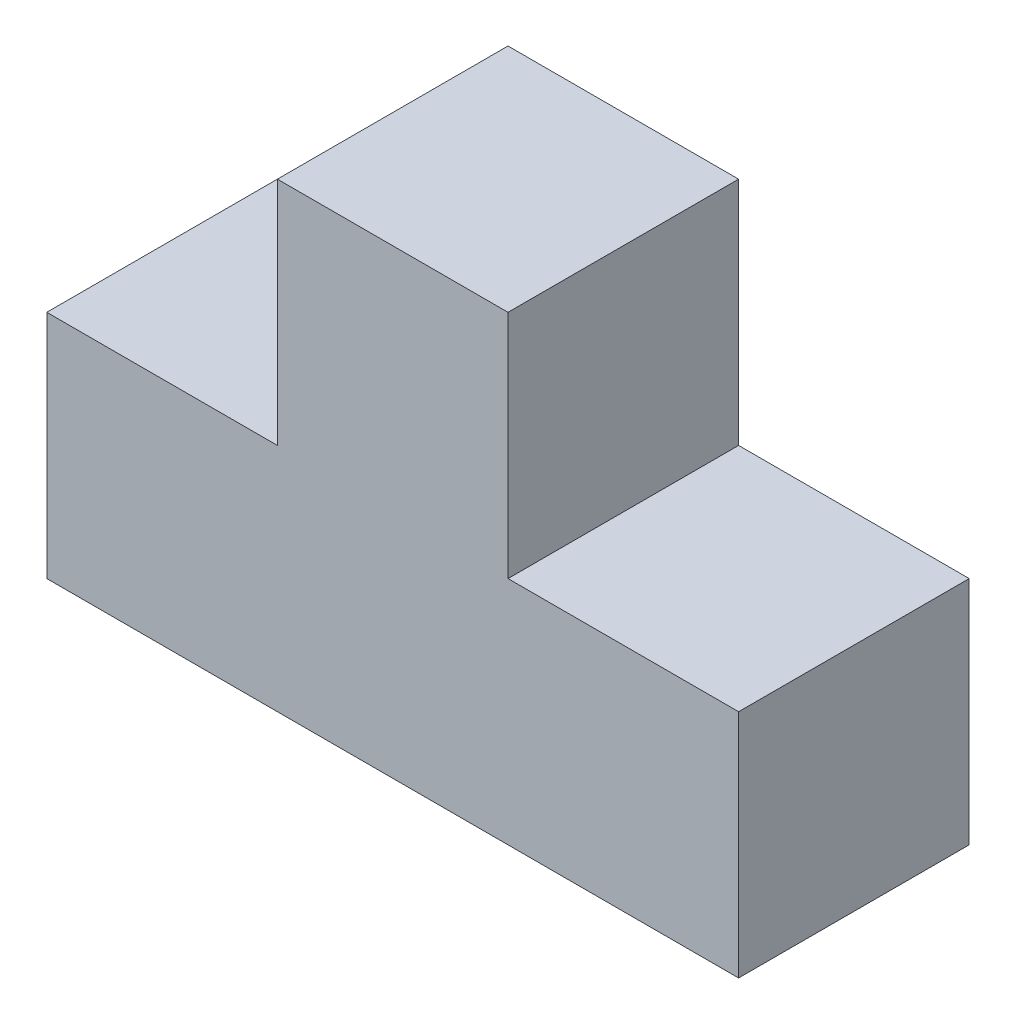
ISO-10303-21;
HEADER;
FILE_DESCRIPTION(('STEP AP214'),'2;1');
FILE_NAME('part.step','',(''),(''),'','','');
FILE_SCHEMA(('AUTOMOTIVE_DESIGN { 1 0 10303 214 1 1 1 1 }'));
ENDSEC;
DATA;
#1=APPLICATION_CONTEXT('core data for automotive mechanical design processes');
#2=APPLICATION_PROTOCOL_DEFINITION('international standard','automotive_design',2000,#1);
#3=PRODUCT_CONTEXT('',#1,'mechanical');
#4=PRODUCT('Part','Part','',(#3));
#5=PRODUCT_RELATED_PRODUCT_CATEGORY('part','',(#4));
#6=PRODUCT_DEFINITION_FORMATION('','',#4);
#7=PRODUCT_DEFINITION_CONTEXT('part definition',#1,'design');
#8=PRODUCT_DEFINITION('design','',#6,#7);
#9=PRODUCT_DEFINITION_SHAPE('','',#8);
#10=(LENGTH_UNIT() NAMED_UNIT(*) SI_UNIT(.MILLI.,.METRE.));
#11=(NAMED_UNIT(*) PLANE_ANGLE_UNIT() SI_UNIT($,.RADIAN.));
#12=(NAMED_UNIT(*) SI_UNIT($,.STERADIAN.) SOLID_ANGLE_UNIT());
#13=UNCERTAINTY_MEASURE_WITH_UNIT(LENGTH_MEASURE(1.E-05),#10,'distance_accuracy_value','');
#14=(GEOMETRIC_REPRESENTATION_CONTEXT(3) GLOBAL_UNCERTAINTY_ASSIGNED_CONTEXT((#13)) GLOBAL_UNIT_ASSIGNED_CONTEXT((#10,
#11,#12)) REPRESENTATION_CONTEXT('',''));
#15=CARTESIAN_POINT('',(0.,0.,0.));
#16=DIRECTION('',(0.,0.,1.));
#17=DIRECTION('',(1.,0.,0.));
#18=AXIS2_PLACEMENT_3D('',#15,#16,#17);
#19=CARTESIAN_POINT('',(0.,30.,30.));
#20=DIRECTION('',(1.,0.,0.));
#21=DIRECTION('',(0.,0.,-1.));
#22=AXIS2_PLACEMENT_3D('',#19,#20,#21);
#23=PLANE('',#22);
#24=DIRECTION('',(0.,-1.,0.));
#25=VECTOR('',#24,1.);
#26=CARTESIAN_POINT('',(0.,30.,0.));
#27=LINE('',#26,#25);
#28=CARTESIAN_POINT('',(0.,30.,0.));
#29=VERTEX_POINT('',#28);
#30=CARTESIAN_POINT('',(0.,0.,0.));
#31=VERTEX_POINT('',#30);
#32=EDGE_CURVE('E144',#29,#31,#27,.T.);
#33=ORIENTED_EDGE('',*,*,#32,.T.);
#34=DIRECTION('',(0.,0.,-1.));
#35=VECTOR('',#34,1.);
#36=CARTESIAN_POINT('',(0.,0.,30.));
#37=LINE('',#36,#35);
#38=CARTESIAN_POINT('',(0.,0.,30.));
#39=VERTEX_POINT('',#38);
#40=EDGE_CURVE('E11',#39,#31,#37,.T.);
#41=ORIENTED_EDGE('',*,*,#40,.F.);
#42=DIRECTION('',(0.,-1.,0.));
#43=VECTOR('',#42,1.);
#44=CARTESIAN_POINT('',(0.,30.,30.));
#45=LINE('',#44,#43);
#46=CARTESIAN_POINT('',(0.,30.,30.));
#47=VERTEX_POINT('',#46);
#48=EDGE_CURVE('E166',#47,#39,#45,.T.);
#49=ORIENTED_EDGE('',*,*,#48,.F.);
#50=DIRECTION('',(0.,0.,-1.));
#51=VECTOR('',#50,1.);
#52=CARTESIAN_POINT('',(0.,30.,30.));
#53=LINE('',#52,#51);
#54=EDGE_CURVE('E140',#47,#29,#53,.T.);
#55=ORIENTED_EDGE('',*,*,#54,.T.);
#56=EDGE_LOOP('',(#33,#41,#49,#55));
#57=FACE_BOUND('',#56,.T.);
#58=ADVANCED_FACE('F43',(#57),#23,.F.);
#59=CARTESIAN_POINT('',(0.,0.,30.));
#60=DIRECTION('',(0.,1.,0.));
#61=DIRECTION('',(0.,0.,1.));
#62=AXIS2_PLACEMENT_3D('',#59,#60,#61);
#63=PLANE('',#62);
#64=DIRECTION('',(1.,0.,0.));
#65=VECTOR('',#64,1.);
#66=CARTESIAN_POINT('',(0.,0.,0.));
#67=LINE('',#66,#65);
#68=CARTESIAN_POINT('',(90.,0.,0.));
#69=VERTEX_POINT('',#68);
#70=EDGE_CURVE('E148',#31,#69,#67,.T.);
#71=ORIENTED_EDGE('',*,*,#70,.T.);
#72=DIRECTION('',(0.,0.,-1.));
#73=VECTOR('',#72,1.);
#74=CARTESIAN_POINT('',(90.,0.,30.));
#75=LINE('',#74,#73);
#76=CARTESIAN_POINT('',(90.,0.,30.));
#77=VERTEX_POINT('',#76);
#78=EDGE_CURVE('E52',#77,#69,#75,.T.);
#79=ORIENTED_EDGE('',*,*,#78,.F.);
#80=DIRECTION('',(1.,0.,0.));
#81=VECTOR('',#80,1.);
#82=CARTESIAN_POINT('',(0.,0.,30.));
#83=LINE('',#82,#81);
#84=EDGE_CURVE('E103',#39,#77,#83,.T.);
#85=ORIENTED_EDGE('',*,*,#84,.F.);
#86=ORIENTED_EDGE('',*,*,#40,.T.);
#87=EDGE_LOOP('',(#71,#79,#85,#86));
#88=FACE_BOUND('',#87,.T.);
#89=ADVANCED_FACE('F212',(#88),#63,.F.);
#90=CARTESIAN_POINT('',(90.,0.,30.));
#91=DIRECTION('',(-1.,0.,0.));
#92=DIRECTION('',(0.,0.,1.));
#93=AXIS2_PLACEMENT_3D('',#90,#91,#92);
#94=PLANE('',#93);
#95=DIRECTION('',(0.,1.,0.));
#96=VECTOR('',#95,1.);
#97=CARTESIAN_POINT('',(90.,0.,0.));
#98=LINE('',#97,#96);
#99=CARTESIAN_POINT('',(90.,30.,0.));
#100=VERTEX_POINT('',#99);
#101=EDGE_CURVE('E151',#69,#100,#98,.T.);
#102=ORIENTED_EDGE('',*,*,#101,.T.);
#103=DIRECTION('',(0.,0.,-1.));
#104=VECTOR('',#103,1.);
#105=CARTESIAN_POINT('',(90.,30.,30.));
#106=LINE('',#105,#104);
#107=CARTESIAN_POINT('',(90.,30.,30.));
#108=VERTEX_POINT('',#107);
#109=EDGE_CURVE('E177',#108,#100,#106,.T.);
#110=ORIENTED_EDGE('',*,*,#109,.F.);
#111=DIRECTION('',(0.,1.,0.));
#112=VECTOR('',#111,1.);
#113=CARTESIAN_POINT('',(90.,0.,30.));
#114=LINE('',#113,#112);
#115=EDGE_CURVE('E187',#77,#108,#114,.T.);
#116=ORIENTED_EDGE('',*,*,#115,.F.);
#117=ORIENTED_EDGE('',*,*,#78,.T.);
#118=EDGE_LOOP('',(#102,#110,#116,#117));
#119=FACE_BOUND('',#118,.T.);
#120=ADVANCED_FACE('F185',(#119),#94,.F.);
#121=CARTESIAN_POINT('',(90.,30.,30.));
#122=DIRECTION('',(0.,-1.,0.));
#123=DIRECTION('',(1.,0.,0.));
#124=AXIS2_PLACEMENT_3D('',#121,#122,#123);
#125=PLANE('',#124);
#126=DIRECTION('',(-1.,0.,0.));
#127=VECTOR('',#126,1.);
#128=CARTESIAN_POINT('',(90.,30.,0.));
#129=LINE('',#128,#127);
#130=CARTESIAN_POINT('',(60.,30.,0.));
#131=VERTEX_POINT('',#130);
#132=EDGE_CURVE('E154',#100,#131,#129,.T.);
#133=ORIENTED_EDGE('',*,*,#132,.T.);
#134=DIRECTION('',(0.,0.,-1.));
#135=VECTOR('',#134,1.);
#136=CARTESIAN_POINT('',(60.,30.,30.));
#137=LINE('',#136,#135);
#138=CARTESIAN_POINT('',(60.,30.,30.));
#139=VERTEX_POINT('',#138);
#140=EDGE_CURVE('E173',#139,#131,#137,.T.);
#141=ORIENTED_EDGE('',*,*,#140,.F.);
#142=DIRECTION('',(-1.,0.,0.));
#143=VECTOR('',#142,1.);
#144=CARTESIAN_POINT('',(90.,30.,30.));
#145=LINE('',#144,#143);
#146=EDGE_CURVE('E200',#108,#139,#145,.T.);
#147=ORIENTED_EDGE('',*,*,#146,.F.);
#148=ORIENTED_EDGE('',*,*,#109,.T.);
#149=EDGE_LOOP('',(#133,#141,#147,#148));
#150=FACE_BOUND('',#149,.T.);
#151=ADVANCED_FACE('F195',(#150),#125,.F.);
#152=CARTESIAN_POINT('',(60.,30.,30.));
#153=DIRECTION('',(-1.,0.,0.));
#154=DIRECTION('',(0.,0.,1.));
#155=AXIS2_PLACEMENT_3D('',#152,#153,#154);
#156=PLANE('',#155);
#157=DIRECTION('',(0.,1.,0.));
#158=VECTOR('',#157,1.);
#159=CARTESIAN_POINT('',(60.,30.,0.));
#160=LINE('',#159,#158);
#161=CARTESIAN_POINT('',(60.,60.,0.));
#162=VERTEX_POINT('',#161);
#163=EDGE_CURVE('E157',#131,#162,#160,.T.);
#164=ORIENTED_EDGE('',*,*,#163,.T.);
#165=DIRECTION('',(0.,0.,-1.));
#166=VECTOR('',#165,1.);
#167=CARTESIAN_POINT('',(60.,60.,30.));
#168=LINE('',#167,#166);
#169=CARTESIAN_POINT('',(60.,60.,30.));
#170=VERTEX_POINT('',#169);
#171=EDGE_CURVE('E133',#170,#162,#168,.T.);
#172=ORIENTED_EDGE('',*,*,#171,.F.);
#173=DIRECTION('',(0.,1.,0.));
#174=VECTOR('',#173,1.);
#175=CARTESIAN_POINT('',(60.,30.,30.));
#176=LINE('',#175,#174);
#177=EDGE_CURVE('E122',#139,#170,#176,.T.);
#178=ORIENTED_EDGE('',*,*,#177,.F.);
#179=ORIENTED_EDGE('',*,*,#140,.T.);
#180=EDGE_LOOP('',(#164,#172,#178,#179));
#181=FACE_BOUND('',#180,.T.);
#182=ADVANCED_FACE('F198',(#181),#156,.F.);
#183=CARTESIAN_POINT('',(60.,60.,30.));
#184=DIRECTION('',(0.,-1.,0.));
#185=DIRECTION('',(1.,0.,0.));
#186=AXIS2_PLACEMENT_3D('',#183,#184,#185);
#187=PLANE('',#186);
#188=DIRECTION('',(-1.,0.,0.));
#189=VECTOR('',#188,1.);
#190=CARTESIAN_POINT('',(60.,60.,0.));
#191=LINE('',#190,#189);
#192=CARTESIAN_POINT('',(30.,60.,0.));
#193=VERTEX_POINT('',#192);
#194=EDGE_CURVE('E131',#162,#193,#191,.T.);
#195=ORIENTED_EDGE('',*,*,#194,.T.);
#196=DIRECTION('',(0.,0.,-1.));
#197=VECTOR('',#196,1.);
#198=CARTESIAN_POINT('',(30.,60.,30.));
#199=LINE('',#198,#197);
#200=CARTESIAN_POINT('',(30.,60.,30.));
#201=VERTEX_POINT('',#200);
#202=EDGE_CURVE('E128',#201,#193,#199,.T.);
#203=ORIENTED_EDGE('',*,*,#202,.F.);
#204=DIRECTION('',(-1.,0.,0.));
#205=VECTOR('',#204,1.);
#206=CARTESIAN_POINT('',(60.,60.,30.));
#207=LINE('',#206,#205);
#208=EDGE_CURVE('E116',#170,#201,#207,.T.);
#209=ORIENTED_EDGE('',*,*,#208,.F.);
#210=ORIENTED_EDGE('',*,*,#171,.T.);
#211=EDGE_LOOP('',(#195,#203,#209,#210));
#212=FACE_BOUND('',#211,.T.);
#213=ADVANCED_FACE('F129',(#212),#187,.F.);
#214=CARTESIAN_POINT('',(30.,60.,30.));
#215=DIRECTION('',(1.,0.,0.));
#216=DIRECTION('',(0.,1.,0.));
#217=AXIS2_PLACEMENT_3D('',#214,#215,#216);
#218=PLANE('',#217);
#219=DIRECTION('',(0.,-1.,0.));
#220=VECTOR('',#219,1.);
#221=CARTESIAN_POINT('',(30.,60.,0.));
#222=LINE('',#221,#220);
#223=CARTESIAN_POINT('',(30.,30.,0.));
#224=VERTEX_POINT('',#223);
#225=EDGE_CURVE('E89',#193,#224,#222,.T.);
#226=ORIENTED_EDGE('',*,*,#225,.T.);
#227=DIRECTION('',(0.,0.,-1.));
#228=VECTOR('',#227,1.);
#229=CARTESIAN_POINT('',(30.,30.,30.));
#230=LINE('',#229,#228);
#231=CARTESIAN_POINT('',(30.,30.,30.));
#232=VERTEX_POINT('',#231);
#233=EDGE_CURVE('E134',#232,#224,#230,.T.);
#234=ORIENTED_EDGE('',*,*,#233,.F.);
#235=DIRECTION('',(0.,-1.,0.));
#236=VECTOR('',#235,1.);
#237=CARTESIAN_POINT('',(30.,60.,30.));
#238=LINE('',#237,#236);
#239=EDGE_CURVE('E120',#201,#232,#238,.T.);
#240=ORIENTED_EDGE('',*,*,#239,.F.);
#241=ORIENTED_EDGE('',*,*,#202,.T.);
#242=EDGE_LOOP('',(#226,#234,#240,#241));
#243=FACE_BOUND('',#242,.T.);
#244=ADVANCED_FACE('F136',(#243),#218,.F.);
#245=CARTESIAN_POINT('',(30.,30.,30.));
#246=DIRECTION('',(0.,-1.,0.));
#247=DIRECTION('',(1.,0.,0.));
#248=AXIS2_PLACEMENT_3D('',#245,#246,#247);
#249=PLANE('',#248);
#250=DIRECTION('',(-1.,0.,0.));
#251=VECTOR('',#250,1.);
#252=CARTESIAN_POINT('',(30.,30.,0.));
#253=LINE('',#252,#251);
#254=EDGE_CURVE('E95',#224,#29,#253,.T.);
#255=ORIENTED_EDGE('',*,*,#254,.T.);
#256=ORIENTED_EDGE('',*,*,#54,.F.);
#257=DIRECTION('',(-1.,0.,0.));
#258=VECTOR('',#257,1.);
#259=CARTESIAN_POINT('',(30.,30.,30.));
#260=LINE('',#259,#258);
#261=EDGE_CURVE('E60',#232,#47,#260,.T.);
#262=ORIENTED_EDGE('',*,*,#261,.F.);
#263=ORIENTED_EDGE('',*,*,#233,.T.);
#264=EDGE_LOOP('',(#255,#256,#262,#263));
#265=FACE_BOUND('',#264,.T.);
#266=ADVANCED_FACE('F228',(#265),#249,.F.);
#267=CARTESIAN_POINT('',(0.,0.,30.));
#268=DIRECTION('',(0.,0.,1.));
#269=DIRECTION('',(1.,0.,0.));
#270=AXIS2_PLACEMENT_3D('',#267,#268,#269);
#271=PLANE('',#270);
#272=ORIENTED_EDGE('',*,*,#48,.T.);
#273=ORIENTED_EDGE('',*,*,#84,.T.);
#274=ORIENTED_EDGE('',*,*,#115,.T.);
#275=ORIENTED_EDGE('',*,*,#146,.T.);
#276=ORIENTED_EDGE('',*,*,#177,.T.);
#277=ORIENTED_EDGE('',*,*,#208,.T.);
#278=ORIENTED_EDGE('',*,*,#239,.T.);
#279=ORIENTED_EDGE('',*,*,#261,.T.);
#280=EDGE_LOOP('',(#272,#273,#274,#275,#276,#277,#278,#279));
#281=FACE_BOUND('',#280,.T.);
#282=ADVANCED_FACE('F118',(#281),#271,.T.);
#283=CARTESIAN_POINT('',(0.,0.,0.));
#284=DIRECTION('',(0.,0.,1.));
#285=DIRECTION('',(1.,0.,0.));
#286=AXIS2_PLACEMENT_3D('',#283,#284,#285);
#287=PLANE('',#286);
#288=ORIENTED_EDGE('',*,*,#32,.F.);
#289=ORIENTED_EDGE('',*,*,#254,.F.);
#290=ORIENTED_EDGE('',*,*,#225,.F.);
#291=ORIENTED_EDGE('',*,*,#194,.F.);
#292=ORIENTED_EDGE('',*,*,#163,.F.);
#293=ORIENTED_EDGE('',*,*,#132,.F.);
#294=ORIENTED_EDGE('',*,*,#101,.F.);
#295=ORIENTED_EDGE('',*,*,#70,.F.);
#296=EDGE_LOOP('',(#288,#289,#290,#291,#292,#293,#294,#295));
#297=FACE_BOUND('',#296,.T.);
#298=ADVANCED_FACE('F191',(#297),#287,.F.);
#299=CLOSED_SHELL('',(#58,#89,#120,#151,#182,#213,#244,#266,#282,#298));
#300=MANIFOLD_SOLID_BREP('B2',#299);
#301=ADVANCED_BREP_SHAPE_REPRESENTATION('',(#18,#300),#14);
#302=SHAPE_DEFINITION_REPRESENTATION(#9,#301);
ENDSEC;
END-ISO-10303-21;
